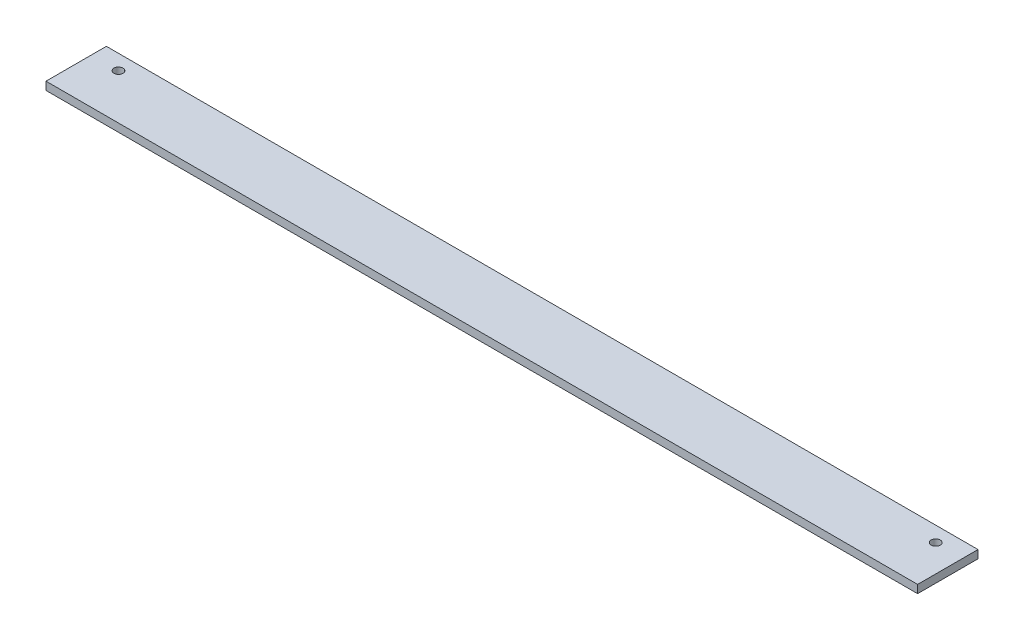
ISO-10303-21;
HEADER;
FILE_DESCRIPTION(('STEP AP214'),'2;1');
FILE_NAME('part.step','',(''),(''),'','','');
FILE_SCHEMA(('AUTOMOTIVE_DESIGN { 1 0 10303 214 1 1 1 1 }'));
ENDSEC;
DATA;
#1=APPLICATION_CONTEXT('core data for automotive mechanical design processes');
#2=APPLICATION_PROTOCOL_DEFINITION('international standard','automotive_design',2000,#1);
#3=PRODUCT_CONTEXT('',#1,'mechanical');
#4=PRODUCT('Part','Part','',(#3));
#5=PRODUCT_RELATED_PRODUCT_CATEGORY('part','',(#4));
#6=PRODUCT_DEFINITION_FORMATION('','',#4);
#7=PRODUCT_DEFINITION_CONTEXT('part definition',#1,'design');
#8=PRODUCT_DEFINITION('design','',#6,#7);
#9=PRODUCT_DEFINITION_SHAPE('','',#8);
#10=(LENGTH_UNIT() NAMED_UNIT(*) SI_UNIT(.MILLI.,.METRE.));
#11=(NAMED_UNIT(*) PLANE_ANGLE_UNIT() SI_UNIT($,.RADIAN.));
#12=(NAMED_UNIT(*) SI_UNIT($,.STERADIAN.) SOLID_ANGLE_UNIT());
#13=UNCERTAINTY_MEASURE_WITH_UNIT(LENGTH_MEASURE(1.E-05),#10,'distance_accuracy_value','');
#14=(GEOMETRIC_REPRESENTATION_CONTEXT(3) GLOBAL_UNCERTAINTY_ASSIGNED_CONTEXT((#13)) GLOBAL_UNIT_ASSIGNED_CONTEXT((#10,
#11,#12)) REPRESENTATION_CONTEXT('',''));
#15=CARTESIAN_POINT('',(0.,0.,0.));
#16=DIRECTION('',(0.,0.,1.));
#17=DIRECTION('',(1.,0.,0.));
#18=AXIS2_PLACEMENT_3D('',#15,#16,#17);
#19=CARTESIAN_POINT('',(433.,-2.,-15.));
#20=DIRECTION('',(0.,0.,1.));
#21=DIRECTION('',(1.,0.,0.));
#22=AXIS2_PLACEMENT_3D('',#19,#20,#21);
#23=PLANE('',#22);
#24=DIRECTION('',(0.,1.,0.));
#25=VECTOR('',#24,1.);
#26=CARTESIAN_POINT('',(0.,-2.,-15.));
#27=LINE('',#26,#25);
#28=CARTESIAN_POINT('',(0.,-2.,-15.));
#29=VERTEX_POINT('',#28);
#30=CARTESIAN_POINT('',(0.,2.,-15.));
#31=VERTEX_POINT('',#30);
#32=EDGE_CURVE('E99',#29,#31,#27,.T.);
#33=ORIENTED_EDGE('',*,*,#32,.T.);
#34=DIRECTION('',(-1.,0.,0.));
#35=VECTOR('',#34,1.);
#36=CARTESIAN_POINT('',(433.,2.,-15.));
#37=LINE('',#36,#35);
#38=CARTESIAN_POINT('',(433.,2.,-15.));
#39=VERTEX_POINT('',#38);
#40=EDGE_CURVE('E11',#39,#31,#37,.T.);
#41=ORIENTED_EDGE('',*,*,#40,.F.);
#42=DIRECTION('',(0.,1.,0.));
#43=VECTOR('',#42,1.);
#44=CARTESIAN_POINT('',(433.,-2.,-15.));
#45=LINE('',#44,#43);
#46=CARTESIAN_POINT('',(433.,-2.,-15.));
#47=VERTEX_POINT('',#46);
#48=EDGE_CURVE('E87',#47,#39,#45,.T.);
#49=ORIENTED_EDGE('',*,*,#48,.F.);
#50=DIRECTION('',(-1.,0.,0.));
#51=VECTOR('',#50,1.);
#52=CARTESIAN_POINT('',(433.,-2.,-15.));
#53=LINE('',#52,#51);
#54=EDGE_CURVE('E95',#47,#29,#53,.T.);
#55=ORIENTED_EDGE('',*,*,#54,.T.);
#56=EDGE_LOOP('',(#33,#41,#49,#55));
#57=FACE_BOUND('',#56,.T.);
#58=ADVANCED_FACE('F36',(#57),#23,.F.);
#59=CARTESIAN_POINT('',(433.,2.,15.));
#60=DIRECTION('',(0.,-1.,0.));
#61=DIRECTION('',(0.,0.,-1.));
#62=AXIS2_PLACEMENT_3D('',#59,#60,#61);
#63=PLANE('',#62);
#64=CARTESIAN_POINT('',(13.5,2.,-7.5));
#65=DIRECTION('',(0.,1.,0.));
#66=DIRECTION('',(0.,0.,1.));
#67=AXIS2_PLACEMENT_3D('',#64,#65,#66);
#68=CIRCLE('',#67,2.25);
#69=CARTESIAN_POINT('',(13.5,2.,-5.25));
#70=VERTEX_POINT('',#69);
#71=EDGE_CURVE('E119',#70,#70,#68,.T.);
#72=ORIENTED_EDGE('',*,*,#71,.F.);
#73=EDGE_LOOP('',(#72));
#74=FACE_BOUND('',#73,.T.);
#75=CARTESIAN_POINT('',(419.5,2.,-7.5));
#76=DIRECTION('',(0.,1.,0.));
#77=DIRECTION('',(0.,0.,1.));
#78=AXIS2_PLACEMENT_3D('',#75,#76,#77);
#79=CIRCLE('',#78,2.24999999999995);
#80=CARTESIAN_POINT('',(419.5,2.,-5.25000000000005));
#81=VERTEX_POINT('',#80);
#82=EDGE_CURVE('E113',#81,#81,#79,.T.);
#83=ORIENTED_EDGE('',*,*,#82,.F.);
#84=EDGE_LOOP('',(#83));
#85=FACE_BOUND('',#84,.T.);
#86=DIRECTION('',(0.,0.,1.));
#87=VECTOR('',#86,1.);
#88=CARTESIAN_POINT('',(0.,2.,15.));
#89=LINE('',#88,#87);
#90=CARTESIAN_POINT('',(0.,2.,15.));
#91=VERTEX_POINT('',#90);
#92=EDGE_CURVE('E91',#31,#91,#89,.T.);
#93=ORIENTED_EDGE('',*,*,#92,.T.);
#94=DIRECTION('',(-1.,0.,0.));
#95=VECTOR('',#94,1.);
#96=CARTESIAN_POINT('',(433.,2.,15.));
#97=LINE('',#96,#95);
#98=CARTESIAN_POINT('',(433.,2.,15.));
#99=VERTEX_POINT('',#98);
#100=EDGE_CURVE('E44',#99,#91,#97,.T.);
#101=ORIENTED_EDGE('',*,*,#100,.F.);
#102=DIRECTION('',(0.,0.,1.));
#103=VECTOR('',#102,1.);
#104=CARTESIAN_POINT('',(433.,2.,15.));
#105=LINE('',#104,#103);
#106=EDGE_CURVE('E82',#39,#99,#105,.T.);
#107=ORIENTED_EDGE('',*,*,#106,.F.);
#108=ORIENTED_EDGE('',*,*,#40,.T.);
#109=EDGE_LOOP('',(#93,#101,#107,#108));
#110=FACE_BOUND('',#109,.T.);
#111=ADVANCED_FACE('F90',(#74,#85,#110),#63,.F.);
#112=CARTESIAN_POINT('',(433.,-2.,15.));
#113=DIRECTION('',(0.,0.,-1.));
#114=DIRECTION('',(-1.,0.,0.));
#115=AXIS2_PLACEMENT_3D('',#112,#113,#114);
#116=PLANE('',#115);
#117=DIRECTION('',(0.,-1.,0.));
#118=VECTOR('',#117,1.);
#119=CARTESIAN_POINT('',(0.,-2.,15.));
#120=LINE('',#119,#118);
#121=CARTESIAN_POINT('',(0.,-2.,15.));
#122=VERTEX_POINT('',#121);
#123=EDGE_CURVE('E69',#91,#122,#120,.T.);
#124=ORIENTED_EDGE('',*,*,#123,.T.);
#125=DIRECTION('',(-1.,0.,0.));
#126=VECTOR('',#125,1.);
#127=CARTESIAN_POINT('',(433.,-2.,15.));
#128=LINE('',#127,#126);
#129=CARTESIAN_POINT('',(433.,-2.,15.));
#130=VERTEX_POINT('',#129);
#131=EDGE_CURVE('E92',#130,#122,#128,.T.);
#132=ORIENTED_EDGE('',*,*,#131,.F.);
#133=DIRECTION('',(0.,-1.,0.));
#134=VECTOR('',#133,1.);
#135=CARTESIAN_POINT('',(433.,-2.,15.));
#136=LINE('',#135,#134);
#137=EDGE_CURVE('E85',#99,#130,#136,.T.);
#138=ORIENTED_EDGE('',*,*,#137,.F.);
#139=ORIENTED_EDGE('',*,*,#100,.T.);
#140=EDGE_LOOP('',(#124,#132,#138,#139));
#141=FACE_BOUND('',#140,.T.);
#142=ADVANCED_FACE('F93',(#141),#116,.F.);
#143=CARTESIAN_POINT('',(433.,-2.,15.));
#144=DIRECTION('',(0.,1.,0.));
#145=DIRECTION('',(0.,0.,1.));
#146=AXIS2_PLACEMENT_3D('',#143,#144,#145);
#147=PLANE('',#146);
#148=CARTESIAN_POINT('',(13.5,-2.,-7.5));
#149=DIRECTION('',(0.,1.,0.));
#150=DIRECTION('',(0.,0.,1.));
#151=AXIS2_PLACEMENT_3D('',#148,#149,#150);
#152=CIRCLE('',#151,2.25);
#153=CARTESIAN_POINT('',(13.5,-2.,-5.25));
#154=VERTEX_POINT('',#153);
#155=EDGE_CURVE('E102',#154,#154,#152,.T.);
#156=ORIENTED_EDGE('',*,*,#155,.T.);
#157=EDGE_LOOP('',(#156));
#158=FACE_BOUND('',#157,.T.);
#159=CARTESIAN_POINT('',(419.5,-2.,-7.5));
#160=DIRECTION('',(0.,1.,0.));
#161=DIRECTION('',(0.,0.,1.));
#162=AXIS2_PLACEMENT_3D('',#159,#160,#161);
#163=CIRCLE('',#162,2.24999999999995);
#164=CARTESIAN_POINT('',(419.5,-2.,-5.25000000000005));
#165=VERTEX_POINT('',#164);
#166=EDGE_CURVE('E116',#165,#165,#163,.T.);
#167=ORIENTED_EDGE('',*,*,#166,.T.);
#168=EDGE_LOOP('',(#167));
#169=FACE_BOUND('',#168,.T.);
#170=DIRECTION('',(0.,0.,-1.));
#171=VECTOR('',#170,1.);
#172=CARTESIAN_POINT('',(0.,-2.,15.));
#173=LINE('',#172,#171);
#174=EDGE_CURVE('E75',#122,#29,#173,.T.);
#175=ORIENTED_EDGE('',*,*,#174,.T.);
#176=ORIENTED_EDGE('',*,*,#54,.F.);
#177=DIRECTION('',(0.,0.,-1.));
#178=VECTOR('',#177,1.);
#179=CARTESIAN_POINT('',(433.,-2.,15.));
#180=LINE('',#179,#178);
#181=EDGE_CURVE('E52',#130,#47,#180,.T.);
#182=ORIENTED_EDGE('',*,*,#181,.F.);
#183=ORIENTED_EDGE('',*,*,#131,.T.);
#184=EDGE_LOOP('',(#175,#176,#182,#183));
#185=FACE_BOUND('',#184,.T.);
#186=ADVANCED_FACE('F107',(#158,#169,#185),#147,.F.);
#187=CARTESIAN_POINT('',(433.,0.,0.));
#188=DIRECTION('',(-1.,0.,0.));
#189=DIRECTION('',(0.,0.,1.));
#190=AXIS2_PLACEMENT_3D('',#187,#188,#189);
#191=PLANE('',#190);
#192=ORIENTED_EDGE('',*,*,#48,.T.);
#193=ORIENTED_EDGE('',*,*,#106,.T.);
#194=ORIENTED_EDGE('',*,*,#137,.T.);
#195=ORIENTED_EDGE('',*,*,#181,.T.);
#196=EDGE_LOOP('',(#192,#193,#194,#195));
#197=FACE_BOUND('',#196,.T.);
#198=ADVANCED_FACE('F83',(#197),#191,.F.);
#199=CARTESIAN_POINT('',(0.,0.,0.));
#200=DIRECTION('',(-1.,0.,0.));
#201=DIRECTION('',(0.,0.,1.));
#202=AXIS2_PLACEMENT_3D('',#199,#200,#201);
#203=PLANE('',#202);
#204=ORIENTED_EDGE('',*,*,#32,.F.);
#205=ORIENTED_EDGE('',*,*,#174,.F.);
#206=ORIENTED_EDGE('',*,*,#123,.F.);
#207=ORIENTED_EDGE('',*,*,#92,.F.);
#208=EDGE_LOOP('',(#204,#205,#206,#207));
#209=FACE_BOUND('',#208,.T.);
#210=ADVANCED_FACE('F110',(#209),#203,.T.);
#211=CARTESIAN_POINT('',(419.5,-2.,-7.5));
#212=DIRECTION('',(0.,1.,0.));
#213=DIRECTION('',(0.,0.,1.));
#214=AXIS2_PLACEMENT_3D('',#211,#212,#213);
#215=CYLINDRICAL_SURFACE('',#214,2.24999999999995);
#216=ORIENTED_EDGE('',*,*,#166,.F.);
#217=EDGE_LOOP('',(#216));
#218=FACE_BOUND('',#217,.T.);
#219=ORIENTED_EDGE('',*,*,#82,.T.);
#220=EDGE_LOOP('',(#219));
#221=FACE_BOUND('',#220,.T.);
#222=ADVANCED_FACE('F130',(#218,#221),#215,.F.);
#223=CARTESIAN_POINT('',(13.5,-2.,-7.5));
#224=DIRECTION('',(0.,1.,0.));
#225=DIRECTION('',(0.,0.,1.));
#226=AXIS2_PLACEMENT_3D('',#223,#224,#225);
#227=CYLINDRICAL_SURFACE('',#226,2.25);
#228=ORIENTED_EDGE('',*,*,#155,.F.);
#229=EDGE_LOOP('',(#228));
#230=FACE_BOUND('',#229,.T.);
#231=ORIENTED_EDGE('',*,*,#71,.T.);
#232=EDGE_LOOP('',(#231));
#233=FACE_BOUND('',#232,.T.);
#234=ADVANCED_FACE('F127',(#230,#233),#227,.F.);
#235=CLOSED_SHELL('',(#58,#111,#142,#186,#198,#210,#222,#234));
#236=MANIFOLD_SOLID_BREP('B2',#235);
#237=ADVANCED_BREP_SHAPE_REPRESENTATION('',(#18,#236),#14);
#238=SHAPE_DEFINITION_REPRESENTATION(#9,#237);
ENDSEC;
END-ISO-10303-21;
